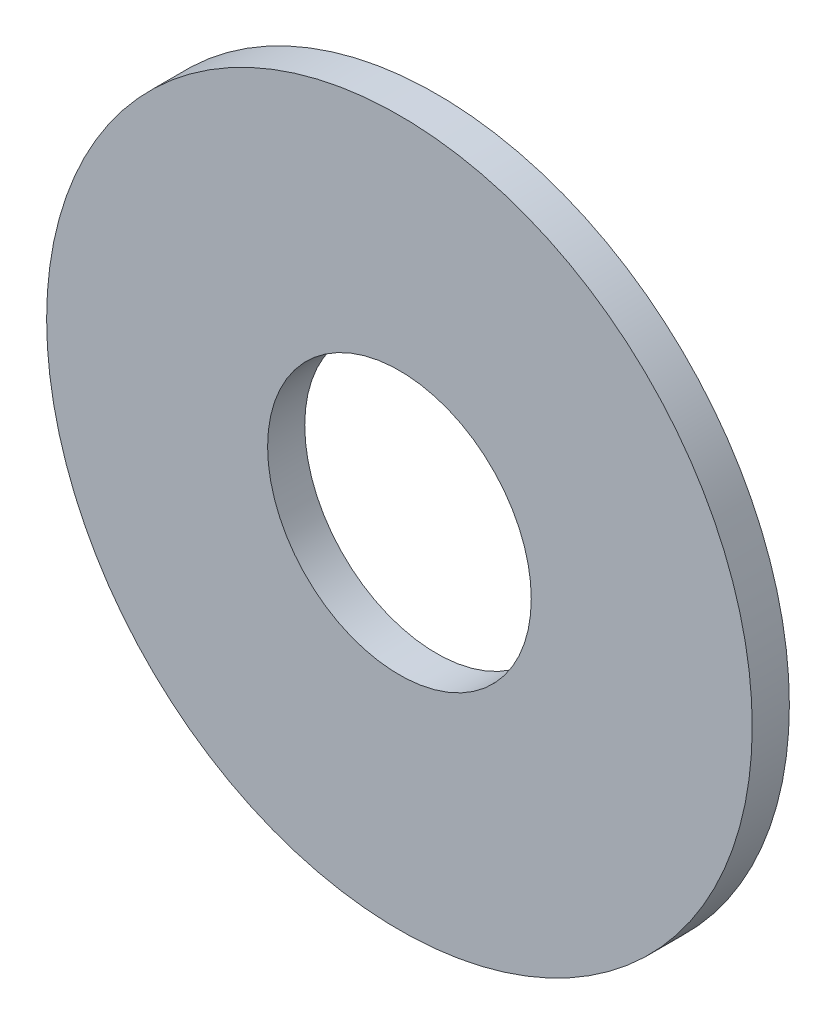
ISO-10303-21;
HEADER;
FILE_DESCRIPTION(('STEP AP214'),'2;1');
FILE_NAME('part.step','',(''),(''),'','','');
FILE_SCHEMA(('AUTOMOTIVE_DESIGN { 1 0 10303 214 1 1 1 1 }'));
ENDSEC;
DATA;
#1=APPLICATION_CONTEXT('core data for automotive mechanical design processes');
#2=APPLICATION_PROTOCOL_DEFINITION('international standard','automotive_design',2000,#1);
#3=PRODUCT_CONTEXT('',#1,'mechanical');
#4=PRODUCT('Part','Part','',(#3));
#5=PRODUCT_RELATED_PRODUCT_CATEGORY('part','',(#4));
#6=PRODUCT_DEFINITION_FORMATION('','',#4);
#7=PRODUCT_DEFINITION_CONTEXT('part definition',#1,'design');
#8=PRODUCT_DEFINITION('design','',#6,#7);
#9=PRODUCT_DEFINITION_SHAPE('','',#8);
#10=(LENGTH_UNIT() NAMED_UNIT(*) SI_UNIT(.MILLI.,.METRE.));
#11=(NAMED_UNIT(*) PLANE_ANGLE_UNIT() SI_UNIT($,.RADIAN.));
#12=(NAMED_UNIT(*) SI_UNIT($,.STERADIAN.) SOLID_ANGLE_UNIT());
#13=UNCERTAINTY_MEASURE_WITH_UNIT(LENGTH_MEASURE(1.E-05),#10,'distance_accuracy_value','');
#14=(GEOMETRIC_REPRESENTATION_CONTEXT(3) GLOBAL_UNCERTAINTY_ASSIGNED_CONTEXT((#13)) GLOBAL_UNIT_ASSIGNED_CONTEXT((#10,
#11,#12)) REPRESENTATION_CONTEXT('',''));
#15=CARTESIAN_POINT('',(0.,0.,0.));
#16=DIRECTION('',(0.,0.,1.));
#17=DIRECTION('',(1.,0.,0.));
#18=AXIS2_PLACEMENT_3D('',#15,#16,#17);
#19=CARTESIAN_POINT('',(0.,0.,1.));
#20=DIRECTION('',(0.,0.,1.));
#21=DIRECTION('',(1.,0.,0.));
#22=AXIS2_PLACEMENT_3D('',#19,#20,#21);
#23=PLANE('',#22);
#24=CARTESIAN_POINT('',(0.,0.,1.));
#25=DIRECTION('',(0.,0.,1.));
#26=DIRECTION('',(1.,0.,0.));
#27=AXIS2_PLACEMENT_3D('',#24,#25,#26);
#28=CIRCLE('',#27,9.5);
#29=CARTESIAN_POINT('',(9.5,0.,1.));
#30=VERTEX_POINT('',#29);
#31=EDGE_CURVE('E10',#30,#30,#28,.T.);
#32=ORIENTED_EDGE('',*,*,#31,.T.);
#33=EDGE_LOOP('',(#32));
#34=FACE_BOUND('',#33,.T.);
#35=CARTESIAN_POINT('',(0.,0.,1.));
#36=DIRECTION('',(0.,0.,1.));
#37=DIRECTION('',(1.,0.,0.));
#38=AXIS2_PLACEMENT_3D('',#35,#36,#37);
#39=CIRCLE('',#38,3.55);
#40=CARTESIAN_POINT('',(3.55,0.,1.));
#41=VERTEX_POINT('',#40);
#42=EDGE_CURVE('E42',#41,#41,#39,.T.);
#43=ORIENTED_EDGE('',*,*,#42,.F.);
#44=EDGE_LOOP('',(#43));
#45=FACE_BOUND('',#44,.T.);
#46=ADVANCED_FACE('F31',(#34,#45),#23,.T.);
#47=CARTESIAN_POINT('',(0.,0.,0.));
#48=DIRECTION('',(0.,0.,1.));
#49=DIRECTION('',(1.,0.,0.));
#50=AXIS2_PLACEMENT_3D('',#47,#48,#49);
#51=PLANE('',#50);
#52=CARTESIAN_POINT('',(0.,0.,0.));
#53=DIRECTION('',(0.,0.,1.));
#54=DIRECTION('',(1.,0.,0.));
#55=AXIS2_PLACEMENT_3D('',#52,#53,#54);
#56=CIRCLE('',#55,9.5);
#57=CARTESIAN_POINT('',(9.5,0.,0.));
#58=VERTEX_POINT('',#57);
#59=EDGE_CURVE('E35',#58,#58,#56,.T.);
#60=ORIENTED_EDGE('',*,*,#59,.F.);
#61=EDGE_LOOP('',(#60));
#62=FACE_BOUND('',#61,.T.);
#63=CARTESIAN_POINT('',(0.,0.,0.));
#64=DIRECTION('',(0.,0.,1.));
#65=DIRECTION('',(1.,0.,0.));
#66=AXIS2_PLACEMENT_3D('',#63,#64,#65);
#67=CIRCLE('',#66,3.55);
#68=CARTESIAN_POINT('',(3.55,0.,0.));
#69=VERTEX_POINT('',#68);
#70=EDGE_CURVE('E44',#69,#69,#67,.T.);
#71=ORIENTED_EDGE('',*,*,#70,.T.);
#72=EDGE_LOOP('',(#71));
#73=FACE_BOUND('',#72,.T.);
#74=ADVANCED_FACE('F54',(#62,#73),#51,.F.);
#75=CARTESIAN_POINT('',(0.,0.,1.));
#76=DIRECTION('',(0.,0.,-1.));
#77=DIRECTION('',(-1.,0.,0.));
#78=AXIS2_PLACEMENT_3D('',#75,#76,#77);
#79=CYLINDRICAL_SURFACE('',#78,9.5);
#80=ORIENTED_EDGE('',*,*,#31,.F.);
#81=EDGE_LOOP('',(#80));
#82=FACE_BOUND('',#81,.T.);
#83=ORIENTED_EDGE('',*,*,#59,.T.);
#84=EDGE_LOOP('',(#83));
#85=FACE_BOUND('',#84,.T.);
#86=ADVANCED_FACE('F33',(#82,#85),#79,.T.);
#87=CARTESIAN_POINT('',(0.,0.,1.));
#88=DIRECTION('',(0.,0.,-1.));
#89=DIRECTION('',(-1.,0.,0.));
#90=AXIS2_PLACEMENT_3D('',#87,#88,#89);
#91=CYLINDRICAL_SURFACE('',#90,3.55);
#92=ORIENTED_EDGE('',*,*,#42,.T.);
#93=EDGE_LOOP('',(#92));
#94=FACE_BOUND('',#93,.T.);
#95=ORIENTED_EDGE('',*,*,#70,.F.);
#96=EDGE_LOOP('',(#95));
#97=FACE_BOUND('',#96,.T.);
#98=ADVANCED_FACE('F50',(#94,#97),#91,.F.);
#99=CLOSED_SHELL('',(#46,#74,#86,#98));
#100=MANIFOLD_SOLID_BREP('B2',#99);
#101=ADVANCED_BREP_SHAPE_REPRESENTATION('',(#18,#100),#14);
#102=SHAPE_DEFINITION_REPRESENTATION(#9,#101);
ENDSEC;
END-ISO-10303-21;
